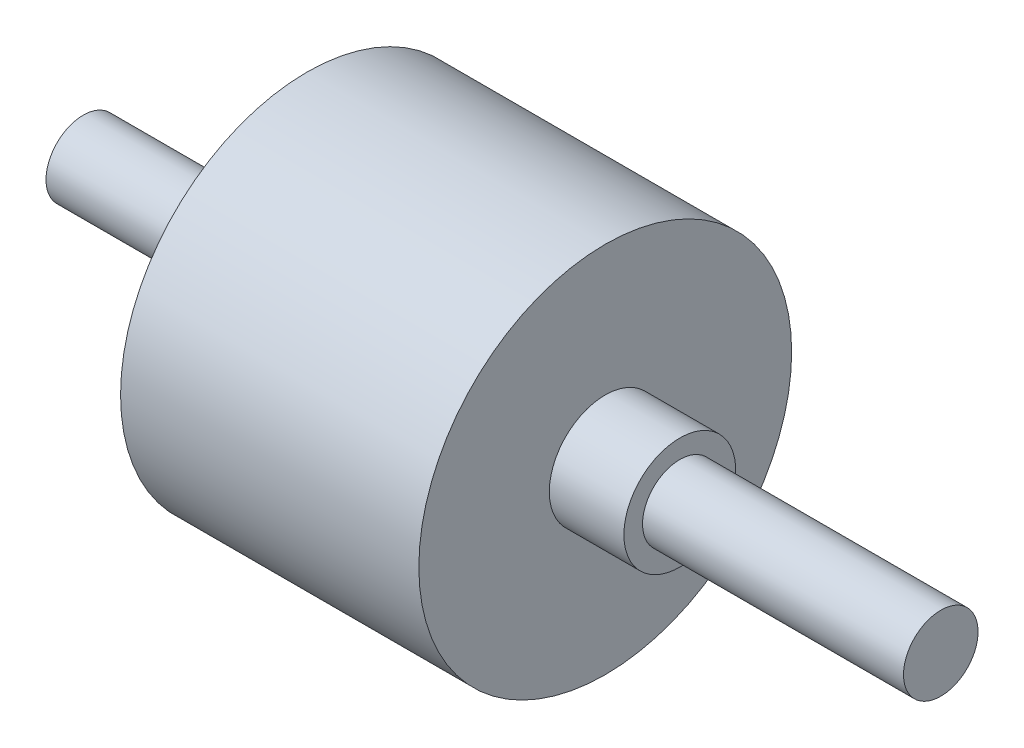
ISO-10303-21;
HEADER;
FILE_DESCRIPTION(('STEP AP214'),'2;1');
FILE_NAME('part.step','',(''),(''),'','','');
FILE_SCHEMA(('AUTOMOTIVE_DESIGN { 1 0 10303 214 1 1 1 1 }'));
ENDSEC;
DATA;
#1=APPLICATION_CONTEXT('core data for automotive mechanical design processes');
#2=APPLICATION_PROTOCOL_DEFINITION('international standard','automotive_design',2000,#1);
#3=PRODUCT_CONTEXT('',#1,'mechanical');
#4=PRODUCT('Part','Part','',(#3));
#5=PRODUCT_RELATED_PRODUCT_CATEGORY('part','',(#4));
#6=PRODUCT_DEFINITION_FORMATION('','',#4);
#7=PRODUCT_DEFINITION_CONTEXT('part definition',#1,'design');
#8=PRODUCT_DEFINITION('design','',#6,#7);
#9=PRODUCT_DEFINITION_SHAPE('','',#8);
#10=(LENGTH_UNIT() NAMED_UNIT(*) SI_UNIT(.MILLI.,.METRE.));
#11=(NAMED_UNIT(*) PLANE_ANGLE_UNIT() SI_UNIT($,.RADIAN.));
#12=(NAMED_UNIT(*) SI_UNIT($,.STERADIAN.) SOLID_ANGLE_UNIT());
#13=UNCERTAINTY_MEASURE_WITH_UNIT(LENGTH_MEASURE(1.E-05),#10,'distance_accuracy_value','');
#14=(GEOMETRIC_REPRESENTATION_CONTEXT(3) GLOBAL_UNCERTAINTY_ASSIGNED_CONTEXT((#13)) GLOBAL_UNIT_ASSIGNED_CONTEXT((#10,
#11,#12)) REPRESENTATION_CONTEXT('',''));
#15=CARTESIAN_POINT('',(0.,0.,0.));
#16=DIRECTION('',(0.,0.,1.));
#17=DIRECTION('',(1.,0.,0.));
#18=AXIS2_PLACEMENT_3D('',#15,#16,#17);
#19=CARTESIAN_POINT('',(0.,0.,0.));
#20=DIRECTION('',(1.,0.,0.));
#21=DIRECTION('',(0.,0.,-1.));
#22=AXIS2_PLACEMENT_3D('',#19,#20,#21);
#23=PLANE('',#22);
#24=CARTESIAN_POINT('',(0.,0.,0.));
#25=DIRECTION('',(-1.,0.,0.));
#26=DIRECTION('',(0.,0.,1.));
#27=AXIS2_PLACEMENT_3D('',#24,#25,#26);
#28=CIRCLE('',#27,5.);
#29=CARTESIAN_POINT('',(0.,0.,5.));
#30=VERTEX_POINT('',#29);
#31=EDGE_CURVE('E10',#30,#30,#28,.T.);
#32=ORIENTED_EDGE('',*,*,#31,.T.);
#33=EDGE_LOOP('',(#32));
#34=FACE_BOUND('',#33,.T.);
#35=ADVANCED_FACE('F41',(#34),#23,.F.);
#36=CARTESIAN_POINT('',(0.,0.,0.));
#37=DIRECTION('',(-1.,0.,0.));
#38=DIRECTION('',(0.,0.,1.));
#39=AXIS2_PLACEMENT_3D('',#36,#37,#38);
#40=CYLINDRICAL_SURFACE('',#39,5.);
#41=ORIENTED_EDGE('',*,*,#31,.F.);
#42=EDGE_LOOP('',(#41));
#43=FACE_BOUND('',#42,.T.);
#44=CARTESIAN_POINT('',(30.,0.,0.));
#45=DIRECTION('',(-1.,0.,0.));
#46=DIRECTION('',(0.,0.,1.));
#47=AXIS2_PLACEMENT_3D('',#44,#45,#46);
#48=CIRCLE('',#47,5.);
#49=CARTESIAN_POINT('',(30.,0.,5.));
#50=VERTEX_POINT('',#49);
#51=EDGE_CURVE('E48',#50,#50,#48,.T.);
#52=ORIENTED_EDGE('',*,*,#51,.T.);
#53=EDGE_LOOP('',(#52));
#54=FACE_BOUND('',#53,.T.);
#55=ADVANCED_FACE('F93',(#43,#54),#40,.T.);
#56=CARTESIAN_POINT('',(30.,0.,-5.));
#57=DIRECTION('',(1.,0.,0.));
#58=DIRECTION('',(0.,0.,-1.));
#59=AXIS2_PLACEMENT_3D('',#56,#57,#58);
#60=PLANE('',#59);
#61=ORIENTED_EDGE('',*,*,#51,.F.);
#62=EDGE_LOOP('',(#61));
#63=FACE_BOUND('',#62,.T.);
#64=CARTESIAN_POINT('',(30.,0.,0.));
#65=DIRECTION('',(-1.,0.,0.));
#66=DIRECTION('',(0.,0.,1.));
#67=AXIS2_PLACEMENT_3D('',#64,#65,#66);
#68=CIRCLE('',#67,25.);
#69=CARTESIAN_POINT('',(30.,0.,25.));
#70=VERTEX_POINT('',#69);
#71=EDGE_CURVE('E53',#70,#70,#68,.T.);
#72=ORIENTED_EDGE('',*,*,#71,.T.);
#73=EDGE_LOOP('',(#72));
#74=FACE_BOUND('',#73,.T.);
#75=ADVANCED_FACE('F97',(#63,#74),#60,.F.);
#76=CARTESIAN_POINT('',(0.,0.,0.));
#77=DIRECTION('',(-1.,0.,0.));
#78=DIRECTION('',(0.,0.,1.));
#79=AXIS2_PLACEMENT_3D('',#76,#77,#78);
#80=CYLINDRICAL_SURFACE('',#79,25.);
#81=ORIENTED_EDGE('',*,*,#71,.F.);
#82=EDGE_LOOP('',(#81));
#83=FACE_BOUND('',#82,.T.);
#84=CARTESIAN_POINT('',(70.,0.,0.));
#85=DIRECTION('',(-1.,0.,0.));
#86=DIRECTION('',(0.,0.,1.));
#87=AXIS2_PLACEMENT_3D('',#84,#85,#86);
#88=CIRCLE('',#87,25.);
#89=CARTESIAN_POINT('',(70.,0.,25.));
#90=VERTEX_POINT('',#89);
#91=EDGE_CURVE('E58',#90,#90,#88,.T.);
#92=ORIENTED_EDGE('',*,*,#91,.T.);
#93=EDGE_LOOP('',(#92));
#94=FACE_BOUND('',#93,.T.);
#95=ADVANCED_FACE('F102',(#83,#94),#80,.T.);
#96=CARTESIAN_POINT('',(70.,0.,-25.));
#97=DIRECTION('',(-1.,0.,0.));
#98=DIRECTION('',(0.,0.,1.));
#99=AXIS2_PLACEMENT_3D('',#96,#97,#98);
#100=PLANE('',#99);
#101=ORIENTED_EDGE('',*,*,#91,.F.);
#102=EDGE_LOOP('',(#101));
#103=FACE_BOUND('',#102,.T.);
#104=CARTESIAN_POINT('',(70.,0.,0.));
#105=DIRECTION('',(-1.,0.,0.));
#106=DIRECTION('',(0.,0.,1.));
#107=AXIS2_PLACEMENT_3D('',#104,#105,#106);
#108=CIRCLE('',#107,7.5);
#109=CARTESIAN_POINT('',(70.,0.,7.5));
#110=VERTEX_POINT('',#109);
#111=EDGE_CURVE('E64',#110,#110,#108,.T.);
#112=ORIENTED_EDGE('',*,*,#111,.T.);
#113=EDGE_LOOP('',(#112));
#114=FACE_BOUND('',#113,.T.);
#115=ADVANCED_FACE('F108',(#103,#114),#100,.F.);
#116=CARTESIAN_POINT('',(0.,0.,0.));
#117=DIRECTION('',(-1.,0.,0.));
#118=DIRECTION('',(0.,0.,1.));
#119=AXIS2_PLACEMENT_3D('',#116,#117,#118);
#120=CYLINDRICAL_SURFACE('',#119,7.5);
#121=ORIENTED_EDGE('',*,*,#111,.F.);
#122=EDGE_LOOP('',(#121));
#123=FACE_BOUND('',#122,.T.);
#124=CARTESIAN_POINT('',(80.,0.,0.));
#125=DIRECTION('',(-1.,0.,0.));
#126=DIRECTION('',(0.,0.,1.));
#127=AXIS2_PLACEMENT_3D('',#124,#125,#126);
#128=CIRCLE('',#127,7.5);
#129=CARTESIAN_POINT('',(80.,0.,7.5));
#130=VERTEX_POINT('',#129);
#131=EDGE_CURVE('E68',#130,#130,#128,.T.);
#132=ORIENTED_EDGE('',*,*,#131,.T.);
#133=EDGE_LOOP('',(#132));
#134=FACE_BOUND('',#133,.T.);
#135=ADVANCED_FACE('F112',(#123,#134),#120,.T.);
#136=CARTESIAN_POINT('',(80.,0.,-7.5));
#137=DIRECTION('',(-1.,0.,0.));
#138=DIRECTION('',(0.,0.,1.));
#139=AXIS2_PLACEMENT_3D('',#136,#137,#138);
#140=PLANE('',#139);
#141=ORIENTED_EDGE('',*,*,#131,.F.);
#142=EDGE_LOOP('',(#141));
#143=FACE_BOUND('',#142,.T.);
#144=CARTESIAN_POINT('',(80.,0.,0.));
#145=DIRECTION('',(-1.,0.,0.));
#146=DIRECTION('',(0.,0.,1.));
#147=AXIS2_PLACEMENT_3D('',#144,#145,#146);
#148=CIRCLE('',#147,5.);
#149=CARTESIAN_POINT('',(80.,0.,5.));
#150=VERTEX_POINT('',#149);
#151=EDGE_CURVE('E72',#150,#150,#148,.T.);
#152=ORIENTED_EDGE('',*,*,#151,.T.);
#153=EDGE_LOOP('',(#152));
#154=FACE_BOUND('',#153,.T.);
#155=ADVANCED_FACE('F89',(#143,#154),#140,.F.);
#156=CARTESIAN_POINT('',(0.,0.,0.));
#157=DIRECTION('',(-1.,0.,0.));
#158=DIRECTION('',(0.,0.,1.));
#159=AXIS2_PLACEMENT_3D('',#156,#157,#158);
#160=CYLINDRICAL_SURFACE('',#159,5.);
#161=ORIENTED_EDGE('',*,*,#151,.F.);
#162=EDGE_LOOP('',(#161));
#163=FACE_BOUND('',#162,.T.);
#164=CARTESIAN_POINT('',(115.,0.,0.));
#165=DIRECTION('',(-1.,0.,0.));
#166=DIRECTION('',(0.,0.,1.));
#167=AXIS2_PLACEMENT_3D('',#164,#165,#166);
#168=CIRCLE('',#167,5.);
#169=CARTESIAN_POINT('',(115.,0.,5.));
#170=VERTEX_POINT('',#169);
#171=EDGE_CURVE('E76',#170,#170,#168,.T.);
#172=ORIENTED_EDGE('',*,*,#171,.T.);
#173=EDGE_LOOP('',(#172));
#174=FACE_BOUND('',#173,.T.);
#175=ADVANCED_FACE('F81',(#163,#174),#160,.T.);
#176=CARTESIAN_POINT('',(115.,0.,-5.));
#177=DIRECTION('',(-1.,0.,0.));
#178=DIRECTION('',(0.,0.,1.));
#179=AXIS2_PLACEMENT_3D('',#176,#177,#178);
#180=PLANE('',#179);
#181=ORIENTED_EDGE('',*,*,#171,.F.);
#182=EDGE_LOOP('',(#181));
#183=FACE_BOUND('',#182,.T.);
#184=ADVANCED_FACE('F83',(#183),#180,.F.);
#185=CLOSED_SHELL('',(#35,#55,#75,#95,#115,#135,#155,#175,#184));
#186=MANIFOLD_SOLID_BREP('B2',#185);
#187=ADVANCED_BREP_SHAPE_REPRESENTATION('',(#18,#186),#14);
#188=SHAPE_DEFINITION_REPRESENTATION(#9,#187);
ENDSEC;
END-ISO-10303-21;
